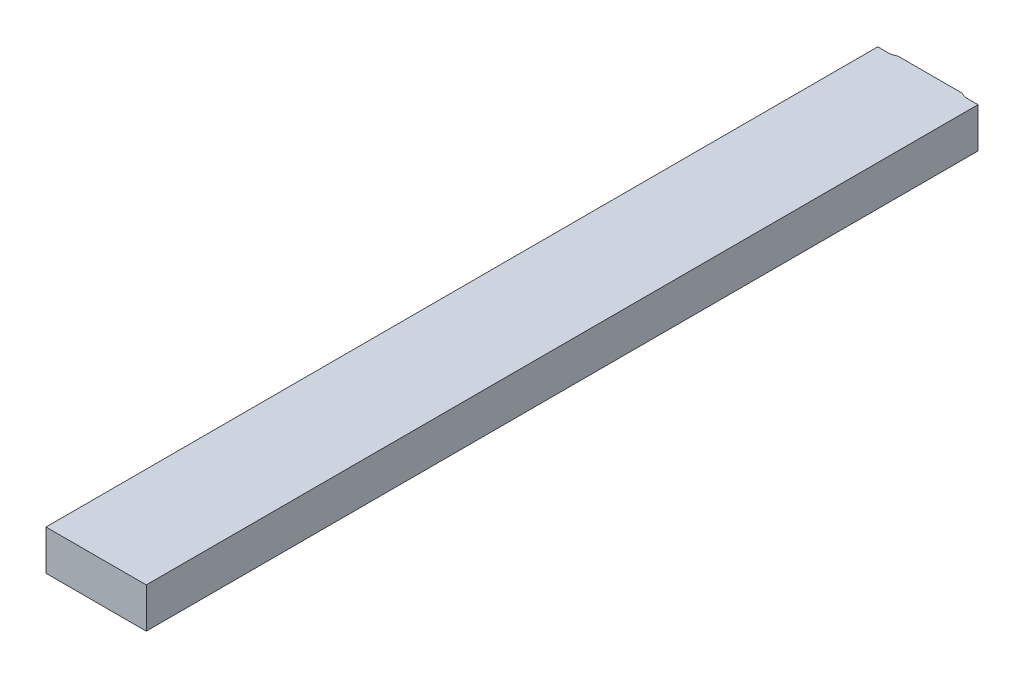
ISO-10303-21;
HEADER;
FILE_DESCRIPTION(('STEP AP214'),'2;1');
FILE_NAME('part.step','',(''),(''),'','','');
FILE_SCHEMA(('AUTOMOTIVE_DESIGN { 1 0 10303 214 1 1 1 1 }'));
ENDSEC;
DATA;
#1=APPLICATION_CONTEXT('core data for automotive mechanical design processes');
#2=APPLICATION_PROTOCOL_DEFINITION('international standard','automotive_design',2000,#1);
#3=PRODUCT_CONTEXT('',#1,'mechanical');
#4=PRODUCT('Part','Part','',(#3));
#5=PRODUCT_RELATED_PRODUCT_CATEGORY('part','',(#4));
#6=PRODUCT_DEFINITION_FORMATION('','',#4);
#7=PRODUCT_DEFINITION_CONTEXT('part definition',#1,'design');
#8=PRODUCT_DEFINITION('design','',#6,#7);
#9=PRODUCT_DEFINITION_SHAPE('','',#8);
#10=(LENGTH_UNIT() NAMED_UNIT(*) SI_UNIT(.MILLI.,.METRE.));
#11=(NAMED_UNIT(*) PLANE_ANGLE_UNIT() SI_UNIT($,.RADIAN.));
#12=(NAMED_UNIT(*) SI_UNIT($,.STERADIAN.) SOLID_ANGLE_UNIT());
#13=UNCERTAINTY_MEASURE_WITH_UNIT(LENGTH_MEASURE(1.E-05),#10,'distance_accuracy_value','');
#14=(GEOMETRIC_REPRESENTATION_CONTEXT(3) GLOBAL_UNCERTAINTY_ASSIGNED_CONTEXT((#13)) GLOBAL_UNIT_ASSIGNED_CONTEXT((#10,
#11,#12)) REPRESENTATION_CONTEXT('',''));
#15=CARTESIAN_POINT('',(0.,0.,0.));
#16=DIRECTION('',(0.,0.,1.));
#17=DIRECTION('',(1.,0.,0.));
#18=AXIS2_PLACEMENT_3D('',#15,#16,#17);
#19=CARTESIAN_POINT('',(3.5,0.275,-4.982138483571));
#20=DIRECTION('',(0.,1.,0.));
#21=DIRECTION('',(0.,0.,1.));
#22=AXIS2_PLACEMENT_3D('',#19,#20,#21);
#23=PLANE('',#22);
#24=DIRECTION('',(1.,0.,0.));
#25=VECTOR('',#24,1.);
#26=CARTESIAN_POINT('',(3.275,0.275,-7.051158663985));
#27=LINE('',#26,#25);
#28=CARTESIAN_POINT('',(3.25,0.275,-7.051158663985));
#29=VERTEX_POINT('',#28);
#30=CARTESIAN_POINT('',(3.30000000000174,0.275,-7.05115866398515));
#31=VERTEX_POINT('',#30);
#32=EDGE_CURVE('E184',#29,#31,#27,.T.);
#33=ORIENTED_EDGE('',*,*,#32,.T.);
#34=CARTESIAN_POINT('',(3.33925609382097,0.275,-7.06145062487903));
#35=CARTESIAN_POINT('',(3.33569437934613,0.275,-7.05943829430754));
#36=CARTESIAN_POINT('',(3.33197691458712,0.275,-7.05770911016996));
#37=CARTESIAN_POINT('',(3.324321331602,0.275,-7.05483826908998));
#38=CARTESIAN_POINT('',(3.32038321330713,0.275,-7.05369661233063));
#39=CARTESIAN_POINT('',(3.31100059388692,0.275,-7.05173413514556));
#40=CARTESIAN_POINT('',(3.3055037799839,0.275,-7.05115865434742));
#41=CARTESIAN_POINT('',(3.30000000000348,0.275,-7.0511586639853));
#42=B_SPLINE_CURVE_WITH_KNOTS('',3,(#34,#35,#36,#37,#38,#39,#40,#41),.UNSPECIFIED.,.F.,.F.,(4,2,
2,4),(0.,0.012254200982866,0.0245084057837979,0.0409766482847964),.UNSPECIFIED.);
#43=CARTESIAN_POINT('',(3.33925609382097,0.275,-7.06145062487903));
#44=VERTEX_POINT('',#43);
#45=EDGE_CURVE('E93',#44,#31,#42,.T.);
#46=ORIENTED_EDGE('',*,*,#45,.F.);
#47=DIRECTION('',(1.,0.,0.));
#48=VECTOR('',#47,1.);
#49=CARTESIAN_POINT('',(3.500000048204,0.275,-7.061450624879));
#50=LINE('',#49,#48);
#51=CARTESIAN_POINT('',(3.660744002588,0.275,-7.06145062487899));
#52=VERTEX_POINT('',#51);
#53=EDGE_CURVE('E89',#44,#52,#50,.T.);
#54=ORIENTED_EDGE('',*,*,#53,.T.);
#55=CARTESIAN_POINT('',(3.69999999999649,0.275,-7.05115866398509));
#56=CARTESIAN_POINT('',(3.69591120722722,0.275,-7.05116284562048));
#57=CARTESIAN_POINT('',(3.69182388666645,0.275,-7.05148113218099));
#58=CARTESIAN_POINT('',(3.68374332584176,0.275,-7.05273057454798));
#59=CARTESIAN_POINT('',(3.67975010047701,0.275,-7.05366182674584));
#60=CARTESIAN_POINT('',(3.67060917233444,0.275,-7.05654480111922));
#61=CARTESIAN_POINT('',(3.66553664971063,0.275,-7.05873731135742));
#62=CARTESIAN_POINT('',(3.660744002588,0.275,-7.06145062487899));
#63=B_SPLINE_CURVE_WITH_KNOTS('',3,(#55,#56,#57,#58,#59,#60,#61,#62),.UNSPECIFIED.,.F.,.F.,(4,2,
2,4),(0.,0.0122527379750506,0.0245074032044947,0.0409759652394033),.UNSPECIFIED.);
#64=CARTESIAN_POINT('',(3.69999999999825,0.275,-7.05115866398504));
#65=VERTEX_POINT('',#64);
#66=EDGE_CURVE('E21',#65,#52,#63,.T.);
#67=ORIENTED_EDGE('',*,*,#66,.F.);
#68=DIRECTION('',(1.,0.,0.));
#69=VECTOR('',#68,1.);
#70=CARTESIAN_POINT('',(3.725,0.275,-7.051158663985));
#71=LINE('',#70,#69);
#72=CARTESIAN_POINT('',(3.75,0.275,-7.051158663985));
#73=VERTEX_POINT('',#72);
#74=EDGE_CURVE('E84',#65,#73,#71,.T.);
#75=ORIENTED_EDGE('',*,*,#74,.T.);
#76=DIRECTION('',(0.,0.,-1.));
#77=VECTOR('',#76,1.);
#78=CARTESIAN_POINT('',(3.75,0.275,-4.976992503125));
#79=LINE('',#78,#77);
#80=CARTESIAN_POINT('',(3.75,0.275,-2.902826342264));
#81=VERTEX_POINT('',#80);
#82=EDGE_CURVE('E218',#81,#73,#79,.T.);
#83=ORIENTED_EDGE('',*,*,#82,.F.);
#84=DIRECTION('',(1.,0.,0.));
#85=VECTOR('',#84,1.);
#86=CARTESIAN_POINT('',(3.5,0.275,-2.902826342264));
#87=LINE('',#86,#85);
#88=CARTESIAN_POINT('',(3.25,0.275,-2.902826342264));
#89=VERTEX_POINT('',#88);
#90=EDGE_CURVE('E204',#89,#81,#87,.T.);
#91=ORIENTED_EDGE('',*,*,#90,.F.);
#92=DIRECTION('',(0.,0.,-1.));
#93=VECTOR('',#92,1.);
#94=CARTESIAN_POINT('',(3.25,0.275,-4.976992503125));
#95=LINE('',#94,#93);
#96=EDGE_CURVE('E176',#89,#29,#95,.T.);
#97=ORIENTED_EDGE('',*,*,#96,.T.);
#98=EDGE_LOOP('',(#33,#46,#54,#67,#75,#83,#91,#97));
#99=FACE_BOUND('',#98,.T.);
#100=ADVANCED_FACE('F17',(#99),#23,.F.);
#101=CARTESIAN_POINT('',(3.75,0.375,-4.976992503125));
#102=DIRECTION('',(1.,0.,0.));
#103=DIRECTION('',(0.,0.,-1.));
#104=AXIS2_PLACEMENT_3D('',#101,#102,#103);
#105=PLANE('',#104);
#106=DIRECTION('',(0.,0.,1.));
#107=VECTOR('',#106,1.);
#108=CARTESIAN_POINT('',(3.75,0.475,-4.982138483571));
#109=LINE('',#108,#107);
#110=CARTESIAN_POINT('',(3.75,0.475,-2.902826342264));
#111=VERTEX_POINT('',#110);
#112=CARTESIAN_POINT('',(3.75,0.475,-7.051158663985));
#113=VERTEX_POINT('',#112);
#114=EDGE_CURVE('E189',#111,#113,#109,.F.);
#115=ORIENTED_EDGE('',*,*,#114,.F.);
#116=DIRECTION('',(0.,1.,0.));
#117=VECTOR('',#116,1.);
#118=CARTESIAN_POINT('',(3.75,0.375,-2.902826342264));
#119=LINE('',#118,#117);
#120=EDGE_CURVE('E203',#81,#111,#119,.T.);
#121=ORIENTED_EDGE('',*,*,#120,.F.);
#122=ORIENTED_EDGE('',*,*,#82,.T.);
#123=DIRECTION('',(0.,1.,0.));
#124=VECTOR('',#123,1.);
#125=CARTESIAN_POINT('',(3.75,0.375,-7.051158663985));
#126=LINE('',#125,#124);
#127=EDGE_CURVE('E233',#73,#113,#126,.T.);
#128=ORIENTED_EDGE('',*,*,#127,.T.);
#129=EDGE_LOOP('',(#115,#121,#122,#128));
#130=FACE_BOUND('',#129,.T.);
#131=ADVANCED_FACE('F238',(#130),#105,.T.);
#132=CARTESIAN_POINT('',(3.725,0.375,-7.051158663985));
#133=DIRECTION('',(0.,0.,1.));
#134=DIRECTION('',(1.,0.,0.));
#135=AXIS2_PLACEMENT_3D('',#132,#133,#134);
#136=PLANE('',#135);
#137=DIRECTION('',(1.,0.,0.));
#138=VECTOR('',#137,1.);
#139=CARTESIAN_POINT('',(3.5,0.475,-7.051158663985));
#140=LINE('',#139,#138);
#141=CARTESIAN_POINT('',(3.69999992664067,0.475,-7.05115866418437));
#142=VERTEX_POINT('',#141);
#143=EDGE_CURVE('E135',#113,#142,#140,.F.);
#144=ORIENTED_EDGE('',*,*,#143,.F.);
#145=ORIENTED_EDGE('',*,*,#127,.F.);
#146=ORIENTED_EDGE('',*,*,#74,.F.);
#147=DIRECTION('',(0.,1.,0.));
#148=VECTOR('',#147,1.);
#149=CARTESIAN_POINT('',(3.7,0.2699679840491,-7.05115866398508));
#150=LINE('',#149,#148);
#151=EDGE_CURVE('E103',#142,#65,#150,.F.);
#152=ORIENTED_EDGE('',*,*,#151,.F.);
#153=EDGE_LOOP('',(#144,#145,#146,#152));
#154=FACE_BOUND('',#153,.T.);
#155=ADVANCED_FACE('F125',(#154),#136,.F.);
#156=CARTESIAN_POINT('',(3.70251960942,0.2699679840491,-7.051190309039));
#157=CARTESIAN_POINT('',(3.70168041762,0.2699679840491,-7.051166943388));
#158=CARTESIAN_POINT('',(3.695615002363,0.2699679840491,-7.051090682037));
#159=CARTESIAN_POINT('',(3.684291413794,0.2699679840491,-7.052195104335));
#160=CARTESIAN_POINT('',(3.671141350335,0.2699679840491,-7.056177217872));
#161=CARTESIAN_POINT('',(3.662024122149,0.2699679840491,-7.060613467733));
#162=CARTESIAN_POINT('',(3.657842502067,0.2699679840491,-7.063145821386));
#163=CARTESIAN_POINT('',(3.656433777303,0.2699679840491,-7.064061090588));
#164=(BOUNDED_CURVE() B_SPLINE_CURVE(3,(#156,#157,#158,#159,#160,#161,#162,#163),.UNSPECIFIED.,
.F.,.F.) B_SPLINE_CURVE_WITH_KNOTS((4,1,1,1,1,4),(0.,0.05196482602247,0.3752098129395,
0.6983604955075,0.8962889073999,1.),
.UNSPECIFIED.) CURVE() GEOMETRIC_REPRESENTATION_ITEM() RATIONAL_B_SPLINE_CURVE((1.,1.,1.,1.,1.,
1.,1.,1.)) REPRESENTATION_ITEM(''));
#165=DIRECTION('',(0.,1.,0.));
#166=VECTOR('',#165,1.);
#167=SURFACE_OF_LINEAR_EXTRUSION('',#164,#166);
#168=ORIENTED_EDGE('',*,*,#66,.T.);
#169=DIRECTION('',(0.,1.,0.));
#170=VECTOR('',#169,1.);
#171=CARTESIAN_POINT('',(3.660744002588,0.375,-7.061450624879));
#172=LINE('',#171,#170);
#173=CARTESIAN_POINT('',(3.660744002588,0.475,-7.061450624879));
#174=VERTEX_POINT('',#173);
#175=EDGE_CURVE('E97',#52,#174,#172,.T.);
#176=ORIENTED_EDGE('',*,*,#175,.T.);
#177=CARTESIAN_POINT('',(3.69999985328134,0.475,-7.05115866438369));
#178=CARTESIAN_POINT('',(3.69591106051827,0.475,-7.0511628532203));
#179=CARTESIAN_POINT('',(3.69182374051207,0.475,-7.05148114713333));
#180=CARTESIAN_POINT('',(3.6837431819355,0.475,-7.05273060421157));
#181=CARTESIAN_POINT('',(3.6797499582645,0.475,-7.05366186376829));
#182=CARTESIAN_POINT('',(3.67060908193835,0.475,-7.05654484039364));
#183=CARTESIAN_POINT('',(3.66553660692722,0.475,-7.05873733584115));
#184=CARTESIAN_POINT('',(3.660744002588,0.475,-7.06145062487899));
#185=B_SPLINE_CURVE_WITH_KNOTS('',3,(#177,#178,#179,#180,#181,#182,#183,#184),.UNSPECIFIED.,.F.,
.F.,(4,2,2,4),(0.,0.012252737988483,0.0245074032339876,0.0409758193004647),.UNSPECIFIED.);
#186=EDGE_CURVE('E129',#142,#174,#185,.T.);
#187=ORIENTED_EDGE('',*,*,#186,.F.);
#188=ORIENTED_EDGE('',*,*,#151,.T.);
#189=EDGE_LOOP('',(#168,#176,#187,#188));
#190=FACE_BOUND('',#189,.T.);
#191=ADVANCED_FACE('F100',(#190),#167,.T.);
#192=CARTESIAN_POINT('',(3.500000048204,0.375,-7.061450624879));
#193=DIRECTION('',(0.,0.,1.));
#194=DIRECTION('',(1.,0.,0.));
#195=AXIS2_PLACEMENT_3D('',#192,#193,#194);
#196=PLANE('',#195);
#197=ORIENTED_EDGE('',*,*,#53,.F.);
#198=DIRECTION('',(0.,1.,0.));
#199=VECTOR('',#198,1.);
#200=CARTESIAN_POINT('',(3.33925609382098,0.2699679840491,-7.06145062487904));
#201=LINE('',#200,#199);
#202=CARTESIAN_POINT('',(3.33925609382098,0.475,-7.06145062487903));
#203=VERTEX_POINT('',#202);
#204=EDGE_CURVE('E109',#203,#44,#201,.F.);
#205=ORIENTED_EDGE('',*,*,#204,.F.);
#206=DIRECTION('',(1.,0.,0.));
#207=VECTOR('',#206,1.);
#208=CARTESIAN_POINT('',(3.5,0.475,-7.061450624879));
#209=LINE('',#208,#207);
#210=EDGE_CURVE('E106',#174,#203,#209,.F.);
#211=ORIENTED_EDGE('',*,*,#210,.F.);
#212=ORIENTED_EDGE('',*,*,#175,.F.);
#213=EDGE_LOOP('',(#197,#205,#211,#212));
#214=FACE_BOUND('',#213,.T.);
#215=ADVANCED_FACE('F104',(#214),#196,.F.);
#216=CARTESIAN_POINT('',(3.343566307542,0.2699679840491,-7.064061118802));
#217=CARTESIAN_POINT('',(3.34215758621,0.2699679840491,-7.063145841608));
#218=CARTESIAN_POINT('',(3.337978107331,0.2699679840491,-7.060614746012));
#219=CARTESIAN_POINT('',(3.32886198488,0.2699679840491,-7.056178456814));
#220=CARTESIAN_POINT('',(3.315712040602,0.2699679840491,-7.052195755785));
#221=CARTESIAN_POINT('',(3.304386746271,0.2699679840491,-7.051090694486));
#222=CARTESIAN_POINT('',(3.298321131782,0.2699679840491,-7.051166937919));
#223=CARTESIAN_POINT('',(3.297482711636,0.2699679840491,-7.051190272618));
#224=(BOUNDED_CURVE() B_SPLINE_CURVE(3,(#216,#217,#218,#219,#220,#221,#222,#223),.UNSPECIFIED.,
.F.,.F.) B_SPLINE_CURVE_WITH_KNOTS((4,1,1,1,1,4),(0.,0.1037158878781,0.3014998794713,
0.6247605212749,0.9480806664175,1.),
.UNSPECIFIED.) CURVE() GEOMETRIC_REPRESENTATION_ITEM() RATIONAL_B_SPLINE_CURVE((1.,1.,1.,1.,1.,
1.,1.,1.)) REPRESENTATION_ITEM(''));
#225=DIRECTION('',(0.,1.,0.));
#226=VECTOR('',#225,1.);
#227=SURFACE_OF_LINEAR_EXTRUSION('',#224,#226);
#228=CARTESIAN_POINT('',(3.33925609382097,0.475,-7.06145062487904));
#229=CARTESIAN_POINT('',(3.33569437936902,0.475,-7.05943829433275));
#230=CARTESIAN_POINT('',(3.33197691459857,0.475,-7.05770911018256));
#231=CARTESIAN_POINT('',(3.32432133159056,0.475,-7.05483826907738));
#232=CARTESIAN_POINT('',(3.32038321328425,0.475,-7.05369661230544));
#233=CARTESIAN_POINT('',(3.31100064163172,0.475,-7.05173414515934));
#234=CARTESIAN_POINT('',(3.30550387761474,0.475,-7.05115866469184));
#235=CARTESIAN_POINT('',(3.30000014681143,0.475,-7.05115866438328));
#236=B_SPLINE_CURVE_WITH_KNOTS('',3,(#228,#229,#230,#231,#232,#233,#234,#235),.UNSPECIFIED.,.F.,
.F.,(4,2,2,4),(0.,0.0122542009828663,0.0245084057837972,0.0409765022206904),.UNSPECIFIED.);
#237=CARTESIAN_POINT('',(3.3,0.475,-7.051158663985));
#238=VERTEX_POINT('',#237);
#239=EDGE_CURVE('E136',#203,#238,#236,.T.);
#240=ORIENTED_EDGE('',*,*,#239,.F.);
#241=ORIENTED_EDGE('',*,*,#204,.T.);
#242=ORIENTED_EDGE('',*,*,#45,.T.);
#243=DIRECTION('',(0.,1.,0.));
#244=VECTOR('',#243,1.);
#245=CARTESIAN_POINT('',(3.3,0.375,-7.051158663985));
#246=LINE('',#245,#244);
#247=EDGE_CURVE('E182',#31,#238,#246,.T.);
#248=ORIENTED_EDGE('',*,*,#247,.T.);
#249=EDGE_LOOP('',(#240,#241,#242,#248));
#250=FACE_BOUND('',#249,.T.);
#251=ADVANCED_FACE('F159',(#250),#227,.T.);
#252=CARTESIAN_POINT('',(3.275,0.375,-7.051158663985));
#253=DIRECTION('',(0.,0.,1.));
#254=DIRECTION('',(1.,0.,0.));
#255=AXIS2_PLACEMENT_3D('',#252,#253,#254);
#256=PLANE('',#255);
#257=DIRECTION('',(1.,0.,0.));
#258=VECTOR('',#257,1.);
#259=CARTESIAN_POINT('',(3.5,0.475,-7.051158663985));
#260=LINE('',#259,#258);
#261=CARTESIAN_POINT('',(3.25,0.475,-7.051158663985));
#262=VERTEX_POINT('',#261);
#263=EDGE_CURVE('E181',#238,#262,#260,.F.);
#264=ORIENTED_EDGE('',*,*,#263,.F.);
#265=ORIENTED_EDGE('',*,*,#247,.F.);
#266=ORIENTED_EDGE('',*,*,#32,.F.);
#267=DIRECTION('',(0.,1.,0.));
#268=VECTOR('',#267,1.);
#269=CARTESIAN_POINT('',(3.25,0.375,-7.051158663985));
#270=LINE('',#269,#268);
#271=EDGE_CURVE('E174',#29,#262,#270,.T.);
#272=ORIENTED_EDGE('',*,*,#271,.T.);
#273=EDGE_LOOP('',(#264,#265,#266,#272));
#274=FACE_BOUND('',#273,.T.);
#275=ADVANCED_FACE('F157',(#274),#256,.F.);
#276=CARTESIAN_POINT('',(3.25,0.375,-4.976992503125));
#277=DIRECTION('',(1.,0.,0.));
#278=DIRECTION('',(0.,0.,-1.));
#279=AXIS2_PLACEMENT_3D('',#276,#277,#278);
#280=PLANE('',#279);
#281=ORIENTED_EDGE('',*,*,#271,.F.);
#282=ORIENTED_EDGE('',*,*,#96,.F.);
#283=DIRECTION('',(0.,1.,0.));
#284=VECTOR('',#283,1.);
#285=CARTESIAN_POINT('',(3.25,0.375,-2.902826342264));
#286=LINE('',#285,#284);
#287=CARTESIAN_POINT('',(3.25,0.475,-2.902826342264));
#288=VERTEX_POINT('',#287);
#289=EDGE_CURVE('E40',#288,#89,#286,.F.);
#290=ORIENTED_EDGE('',*,*,#289,.F.);
#291=DIRECTION('',(0.,0.,1.));
#292=VECTOR('',#291,1.);
#293=CARTESIAN_POINT('',(3.25,0.475,-4.982138483571));
#294=LINE('',#293,#292);
#295=EDGE_CURVE('E31',#262,#288,#294,.T.);
#296=ORIENTED_EDGE('',*,*,#295,.F.);
#297=EDGE_LOOP('',(#281,#282,#290,#296));
#298=FACE_BOUND('',#297,.T.);
#299=ADVANCED_FACE('F153',(#298),#280,.F.);
#300=CARTESIAN_POINT('',(3.5,0.375,-2.902826342264));
#301=DIRECTION('',(0.,0.,1.));
#302=DIRECTION('',(1.,0.,0.));
#303=AXIS2_PLACEMENT_3D('',#300,#301,#302);
#304=PLANE('',#303);
#305=ORIENTED_EDGE('',*,*,#120,.T.);
#306=DIRECTION('',(1.,0.,0.));
#307=VECTOR('',#306,1.);
#308=CARTESIAN_POINT('',(3.5,0.475,-2.902826342264));
#309=LINE('',#308,#307);
#310=EDGE_CURVE('E11',#288,#111,#309,.T.);
#311=ORIENTED_EDGE('',*,*,#310,.F.);
#312=ORIENTED_EDGE('',*,*,#289,.T.);
#313=ORIENTED_EDGE('',*,*,#90,.T.);
#314=EDGE_LOOP('',(#305,#311,#312,#313));
#315=FACE_BOUND('',#314,.T.);
#316=ADVANCED_FACE('F148',(#315),#304,.T.);
#317=CARTESIAN_POINT('',(3.5,0.475,-4.982138483571));
#318=DIRECTION('',(0.,1.,0.));
#319=DIRECTION('',(0.,0.,1.));
#320=AXIS2_PLACEMENT_3D('',#317,#318,#319);
#321=PLANE('',#320);
#322=ORIENTED_EDGE('',*,*,#295,.T.);
#323=ORIENTED_EDGE('',*,*,#310,.T.);
#324=ORIENTED_EDGE('',*,*,#114,.T.);
#325=ORIENTED_EDGE('',*,*,#143,.T.);
#326=ORIENTED_EDGE('',*,*,#186,.T.);
#327=ORIENTED_EDGE('',*,*,#210,.T.);
#328=ORIENTED_EDGE('',*,*,#239,.T.);
#329=ORIENTED_EDGE('',*,*,#263,.T.);
#330=EDGE_LOOP('',(#322,#323,#324,#325,#326,#327,#328,#329));
#331=FACE_BOUND('',#330,.T.);
#332=ADVANCED_FACE('F144',(#331),#321,.T.);
#333=CLOSED_SHELL('',(#100,#131,#155,#191,#215,#251,#275,#299,#316,#332));
#334=MANIFOLD_SOLID_BREP('B1',#333);
#335=ADVANCED_BREP_SHAPE_REPRESENTATION('',(#18,#334),#14);
#336=SHAPE_DEFINITION_REPRESENTATION(#9,#335);
ENDSEC;
END-ISO-10303-21;
